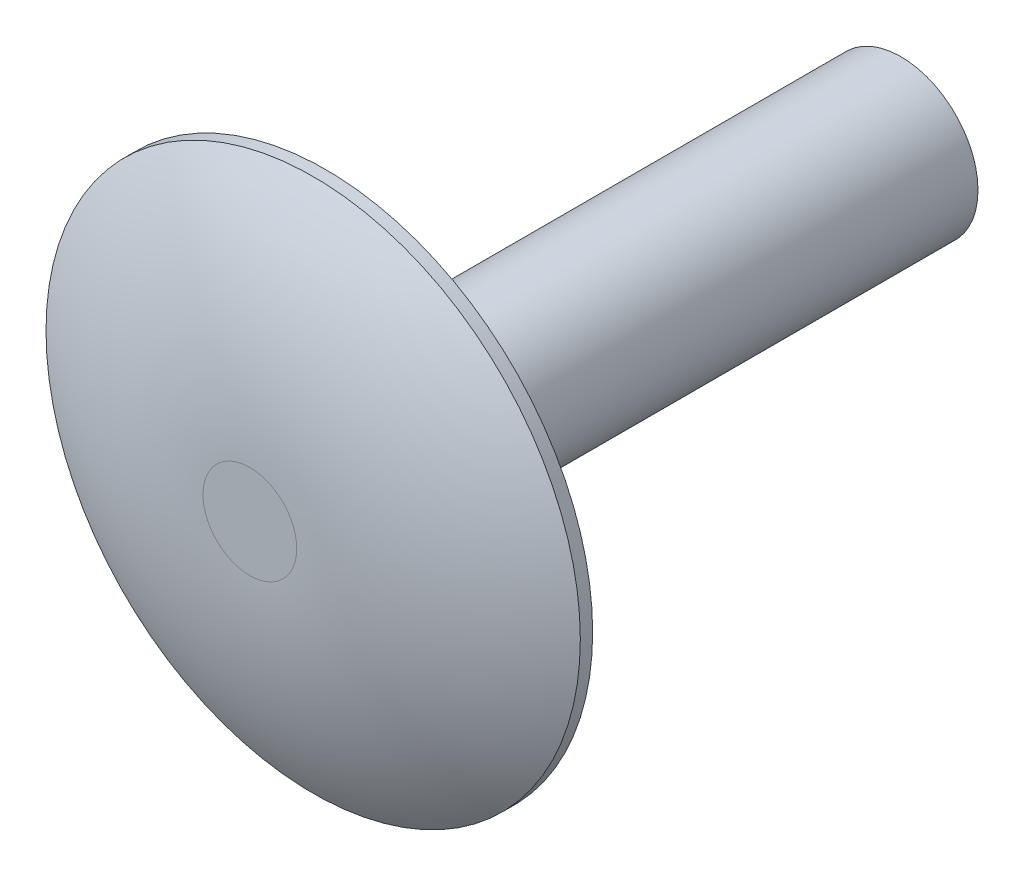
ISO-10303-21;
HEADER;
FILE_DESCRIPTION(('STEP AP214'),'2;1');
FILE_NAME('part.step','',(''),(''),'','','');
FILE_SCHEMA(('AUTOMOTIVE_DESIGN { 1 0 10303 214 1 1 1 1 }'));
ENDSEC;
DATA;
#1=APPLICATION_CONTEXT('core data for automotive mechanical design processes');
#2=APPLICATION_PROTOCOL_DEFINITION('international standard','automotive_design',2000,#1);
#3=PRODUCT_CONTEXT('',#1,'mechanical');
#4=PRODUCT('Part','Part','',(#3));
#5=PRODUCT_RELATED_PRODUCT_CATEGORY('part','',(#4));
#6=PRODUCT_DEFINITION_FORMATION('','',#4);
#7=PRODUCT_DEFINITION_CONTEXT('part definition',#1,'design');
#8=PRODUCT_DEFINITION('design','',#6,#7);
#9=PRODUCT_DEFINITION_SHAPE('','',#8);
#10=(LENGTH_UNIT() NAMED_UNIT(*) SI_UNIT(.MILLI.,.METRE.));
#11=(NAMED_UNIT(*) PLANE_ANGLE_UNIT() SI_UNIT($,.RADIAN.));
#12=(NAMED_UNIT(*) SI_UNIT($,.STERADIAN.) SOLID_ANGLE_UNIT());
#13=UNCERTAINTY_MEASURE_WITH_UNIT(LENGTH_MEASURE(1.E-05),#10,'distance_accuracy_value','');
#14=(GEOMETRIC_REPRESENTATION_CONTEXT(3) GLOBAL_UNCERTAINTY_ASSIGNED_CONTEXT((#13)) GLOBAL_UNIT_ASSIGNED_CONTEXT((#10,
#11,#12)) REPRESENTATION_CONTEXT('',''));
#15=CARTESIAN_POINT('',(0.,0.,0.));
#16=DIRECTION('',(0.,0.,1.));
#17=DIRECTION('',(1.,0.,0.));
#18=AXIS2_PLACEMENT_3D('',#15,#16,#17);
#19=CARTESIAN_POINT('',(0.,0.,2.3368));
#20=DIRECTION('',(0.,0.,-1.));
#21=DIRECTION('',(-1.,0.,0.));
#22=AXIS2_PLACEMENT_3D('',#19,#20,#21);
#23=CYLINDRICAL_SURFACE('',#22,8.255);
#24=CARTESIAN_POINT('',(0.,0.,0.));
#25=DIRECTION('',(0.,0.,1.));
#26=DIRECTION('',(1.,0.,0.));
#27=AXIS2_PLACEMENT_3D('',#24,#25,#26);
#28=CIRCLE('',#27,8.255);
#29=CARTESIAN_POINT('',(8.255,0.,0.));
#30=VERTEX_POINT('',#29);
#31=EDGE_CURVE('E10',#30,#30,#28,.T.);
#32=ORIENTED_EDGE('',*,*,#31,.T.);
#33=EDGE_LOOP('',(#32));
#34=FACE_BOUND('',#33,.T.);
#35=CARTESIAN_POINT('',(0.,0.,0.381));
#36=DIRECTION('',(0.,0.,1.));
#37=DIRECTION('',(1.,0.,0.));
#38=AXIS2_PLACEMENT_3D('',#35,#36,#37);
#39=CIRCLE('',#38,8.255);
#40=CARTESIAN_POINT('',(8.255,0.,0.381));
#41=VERTEX_POINT('',#40);
#42=EDGE_CURVE('E54',#41,#41,#39,.T.);
#43=ORIENTED_EDGE('',*,*,#42,.F.);
#44=EDGE_LOOP('',(#43));
#45=FACE_BOUND('',#44,.T.);
#46=ADVANCED_FACE('F35',(#34,#45),#23,.T.);
#47=CARTESIAN_POINT('',(0.,0.,0.));
#48=DIRECTION('',(0.,0.,1.));
#49=DIRECTION('',(1.,0.,0.));
#50=AXIS2_PLACEMENT_3D('',#47,#48,#49);
#51=PLANE('',#50);
#52=CARTESIAN_POINT('',(0.,0.,0.));
#53=DIRECTION('',(0.,0.,1.));
#54=DIRECTION('',(1.,0.,0.));
#55=AXIS2_PLACEMENT_3D('',#52,#53,#54);
#56=CIRCLE('',#55,2.38125);
#57=CARTESIAN_POINT('',(2.38125,0.,0.));
#58=VERTEX_POINT('',#57);
#59=EDGE_CURVE('E45',#58,#58,#56,.T.);
#60=ORIENTED_EDGE('',*,*,#59,.T.);
#61=EDGE_LOOP('',(#60));
#62=FACE_BOUND('',#61,.T.);
#63=ORIENTED_EDGE('',*,*,#31,.F.);
#64=EDGE_LOOP('',(#63));
#65=FACE_BOUND('',#64,.T.);
#66=ADVANCED_FACE('F62',(#62,#65),#51,.F.);
#67=CARTESIAN_POINT('',(0.,0.,-17.78));
#68=DIRECTION('',(0.,0.,1.));
#69=DIRECTION('',(1.,0.,0.));
#70=AXIS2_PLACEMENT_3D('',#67,#68,#69);
#71=CYLINDRICAL_SURFACE('',#70,2.38125);
#72=CARTESIAN_POINT('',(0.,0.,-17.78));
#73=DIRECTION('',(0.,0.,1.));
#74=DIRECTION('',(1.,0.,0.));
#75=AXIS2_PLACEMENT_3D('',#72,#73,#74);
#76=CIRCLE('',#75,2.38125);
#77=CARTESIAN_POINT('',(2.38125,0.,-17.78));
#78=VERTEX_POINT('',#77);
#79=EDGE_CURVE('E41',#78,#78,#76,.T.);
#80=ORIENTED_EDGE('',*,*,#79,.T.);
#81=EDGE_LOOP('',(#80));
#82=FACE_BOUND('',#81,.T.);
#83=ORIENTED_EDGE('',*,*,#59,.F.);
#84=EDGE_LOOP('',(#83));
#85=FACE_BOUND('',#84,.T.);
#86=ADVANCED_FACE('F68',(#82,#85),#71,.T.);
#87=CARTESIAN_POINT('',(0.,0.,-17.78));
#88=DIRECTION('',(0.,0.,1.));
#89=DIRECTION('',(1.,0.,0.));
#90=AXIS2_PLACEMENT_3D('',#87,#88,#89);
#91=PLANE('',#90);
#92=ORIENTED_EDGE('',*,*,#79,.F.);
#93=EDGE_LOOP('',(#92));
#94=FACE_BOUND('',#93,.T.);
#95=ADVANCED_FACE('F73',(#94),#91,.F.);
#96=CARTESIAN_POINT('',(0.,0.,-10.4873961038961));
#97=DIRECTION('',(0.,0.,1.));
#98=DIRECTION('',(1.,0.,0.));
#99=AXIS2_PLACEMENT_3D('',#96,#97,#98);
#100=DEGENERATE_TOROIDAL_SURFACE('',#99,1.4478,12.8241961038961,.T.);
#101=ORIENTED_EDGE('',*,*,#42,.T.);
#102=EDGE_LOOP('',(#101));
#103=FACE_BOUND('',#102,.T.);
#104=CARTESIAN_POINT('',(0.,0.,2.3368));
#105=DIRECTION('',(0.,0.,1.));
#106=DIRECTION('',(1.,0.,0.));
#107=AXIS2_PLACEMENT_3D('',#104,#105,#106);
#108=CIRCLE('',#107,1.4478);
#109=CARTESIAN_POINT('',(1.4478,0.,2.3368));
#110=VERTEX_POINT('',#109);
#111=EDGE_CURVE('E50',#110,#110,#108,.T.);
#112=ORIENTED_EDGE('',*,*,#111,.F.);
#113=EDGE_LOOP('',(#112));
#114=FACE_BOUND('',#113,.T.);
#115=ADVANCED_FACE('F58',(#103,#114),#100,.T.);
#116=CARTESIAN_POINT('',(0.,0.,2.3368));
#117=DIRECTION('',(0.,0.,1.));
#118=DIRECTION('',(1.,0.,0.));
#119=AXIS2_PLACEMENT_3D('',#116,#117,#118);
#120=PLANE('',#119);
#121=ORIENTED_EDGE('',*,*,#111,.T.);
#122=EDGE_LOOP('',(#121));
#123=FACE_BOUND('',#122,.T.);
#124=ADVANCED_FACE('F77',(#123),#120,.T.);
#125=CLOSED_SHELL('',(#46,#66,#86,#95,#115,#124));
#126=MANIFOLD_SOLID_BREP('B2',#125);
#127=ADVANCED_BREP_SHAPE_REPRESENTATION('',(#18,#126),#14);
#128=SHAPE_DEFINITION_REPRESENTATION(#9,#127);
ENDSEC;
END-ISO-10303-21;
